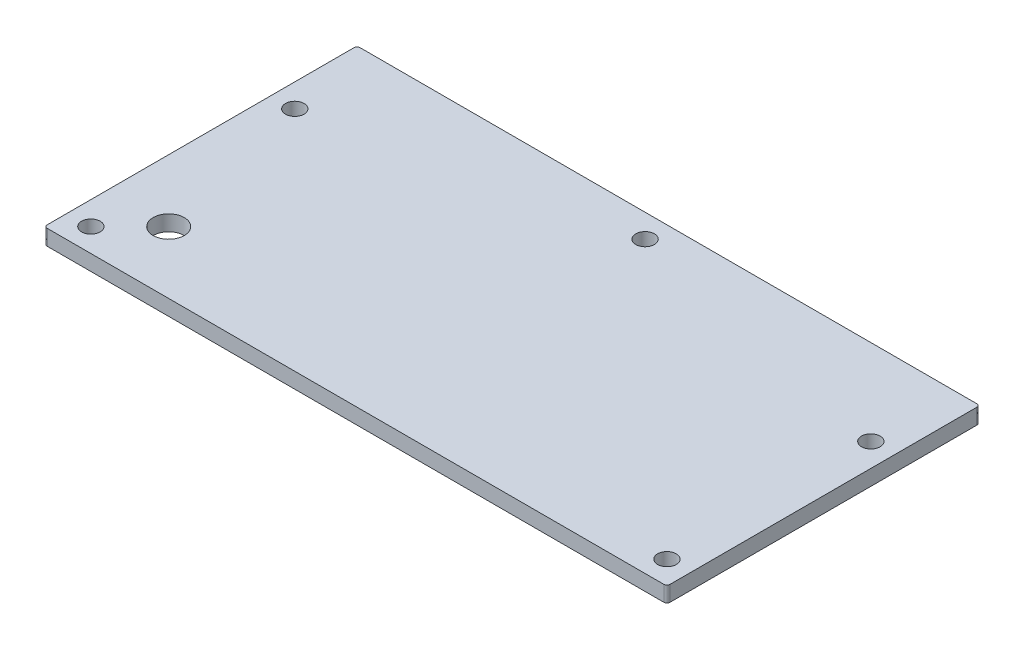
ISO-10303-21;
HEADER;
FILE_DESCRIPTION(('STEP AP214'),'2;1');
FILE_NAME('part.step','',(''),(''),'','','');
FILE_SCHEMA(('AUTOMOTIVE_DESIGN { 1 0 10303 214 1 1 1 1 }'));
ENDSEC;
DATA;
#1=APPLICATION_CONTEXT('core data for automotive mechanical design processes');
#2=APPLICATION_PROTOCOL_DEFINITION('international standard','automotive_design',2000,#1);
#3=PRODUCT_CONTEXT('',#1,'mechanical');
#4=PRODUCT('Part','Part','',(#3));
#5=PRODUCT_RELATED_PRODUCT_CATEGORY('part','',(#4));
#6=PRODUCT_DEFINITION_FORMATION('','',#4);
#7=PRODUCT_DEFINITION_CONTEXT('part definition',#1,'design');
#8=PRODUCT_DEFINITION('design','',#6,#7);
#9=PRODUCT_DEFINITION_SHAPE('','',#8);
#10=(LENGTH_UNIT() NAMED_UNIT(*) SI_UNIT(.MILLI.,.METRE.));
#11=(NAMED_UNIT(*) PLANE_ANGLE_UNIT() SI_UNIT($,.RADIAN.));
#12=(NAMED_UNIT(*) SI_UNIT($,.STERADIAN.) SOLID_ANGLE_UNIT());
#13=UNCERTAINTY_MEASURE_WITH_UNIT(LENGTH_MEASURE(1.E-05),#10,'distance_accuracy_value','');
#14=(GEOMETRIC_REPRESENTATION_CONTEXT(3) GLOBAL_UNCERTAINTY_ASSIGNED_CONTEXT((#13)) GLOBAL_UNIT_ASSIGNED_CONTEXT((#10,
#11,#12)) REPRESENTATION_CONTEXT('',''));
#15=CARTESIAN_POINT('',(0.,0.,0.));
#16=DIRECTION('',(0.,0.,1.));
#17=DIRECTION('',(1.,0.,0.));
#18=AXIS2_PLACEMENT_3D('',#15,#16,#17);
#19=CARTESIAN_POINT('',(63.5,3.175,31.9024));
#20=DIRECTION('',(-1.,0.,0.));
#21=DIRECTION('',(0.,0.,1.));
#22=AXIS2_PLACEMENT_3D('',#19,#20,#21);
#23=PLANE('',#22);
#24=DIRECTION('',(0.,0.,-1.));
#25=VECTOR('',#24,1.);
#26=CARTESIAN_POINT('',(63.5,3.175,31.9024));
#27=LINE('',#26,#25);
#28=CARTESIAN_POINT('',(63.5,3.175,31.2674));
#29=VERTEX_POINT('',#28);
#30=CARTESIAN_POINT('',(63.5,3.175,-31.2674));
#31=VERTEX_POINT('',#30);
#32=EDGE_CURVE('E127',#29,#31,#27,.T.);
#33=ORIENTED_EDGE('',*,*,#32,.F.);
#34=DIRECTION('',(0.,-1.,0.));
#35=VECTOR('',#34,1.);
#36=CARTESIAN_POINT('',(63.5,3.175,31.2674));
#37=LINE('',#36,#35);
#38=CARTESIAN_POINT('',(63.5,0.,31.2674));
#39=VERTEX_POINT('',#38);
#40=EDGE_CURVE('E153',#29,#39,#37,.T.);
#41=ORIENTED_EDGE('',*,*,#40,.T.);
#42=DIRECTION('',(0.,0.,-1.));
#43=VECTOR('',#42,1.);
#44=CARTESIAN_POINT('',(63.5,0.,31.9024));
#45=LINE('',#44,#43);
#46=CARTESIAN_POINT('',(63.5,0.,-31.2674));
#47=VERTEX_POINT('',#46);
#48=EDGE_CURVE('E159',#39,#47,#45,.T.);
#49=ORIENTED_EDGE('',*,*,#48,.T.);
#50=DIRECTION('',(0.,-1.,0.));
#51=VECTOR('',#50,1.);
#52=CARTESIAN_POINT('',(63.5,3.175,-31.2674));
#53=LINE('',#52,#51);
#54=EDGE_CURVE('E151',#47,#31,#53,.F.);
#55=ORIENTED_EDGE('',*,*,#54,.T.);
#56=EDGE_LOOP('',(#33,#41,#49,#55));
#57=FACE_BOUND('',#56,.T.);
#58=ADVANCED_FACE('F35',(#57),#23,.F.);
#59=CARTESIAN_POINT('',(-63.5,3.175,-31.9024));
#60=DIRECTION('',(0.,0.,1.));
#61=DIRECTION('',(1.,0.,0.));
#62=AXIS2_PLACEMENT_3D('',#59,#60,#61);
#63=PLANE('',#62);
#64=DIRECTION('',(-1.,0.,0.));
#65=VECTOR('',#64,1.);
#66=CARTESIAN_POINT('',(-63.5,3.175,-31.9024));
#67=LINE('',#66,#65);
#68=CARTESIAN_POINT('',(62.865,3.175,-31.9024));
#69=VERTEX_POINT('',#68);
#70=CARTESIAN_POINT('',(-62.865,3.175,-31.9024));
#71=VERTEX_POINT('',#70);
#72=EDGE_CURVE('E130',#69,#71,#67,.T.);
#73=ORIENTED_EDGE('',*,*,#72,.F.);
#74=DIRECTION('',(0.,-1.,0.));
#75=VECTOR('',#74,1.);
#76=CARTESIAN_POINT('',(62.865,3.175,-31.9024));
#77=LINE('',#76,#75);
#78=CARTESIAN_POINT('',(62.865,0.,-31.9024));
#79=VERTEX_POINT('',#78);
#80=EDGE_CURVE('E11',#69,#79,#77,.T.);
#81=ORIENTED_EDGE('',*,*,#80,.T.);
#82=DIRECTION('',(-1.,0.,0.));
#83=VECTOR('',#82,1.);
#84=CARTESIAN_POINT('',(-63.5,0.,-31.9024));
#85=LINE('',#84,#83);
#86=CARTESIAN_POINT('',(-62.865,0.,-31.9024));
#87=VERTEX_POINT('',#86);
#88=EDGE_CURVE('E132',#79,#87,#85,.T.);
#89=ORIENTED_EDGE('',*,*,#88,.T.);
#90=DIRECTION('',(0.,-1.,0.));
#91=VECTOR('',#90,1.);
#92=CARTESIAN_POINT('',(-62.865,3.175,-31.9024));
#93=LINE('',#92,#91);
#94=EDGE_CURVE('E43',#87,#71,#93,.F.);
#95=ORIENTED_EDGE('',*,*,#94,.T.);
#96=EDGE_LOOP('',(#73,#81,#89,#95));
#97=FACE_BOUND('',#96,.T.);
#98=ADVANCED_FACE('F236',(#97),#63,.F.);
#99=CARTESIAN_POINT('',(-63.5,3.175,31.9024));
#100=DIRECTION('',(1.,0.,0.));
#101=DIRECTION('',(0.,0.,-1.));
#102=AXIS2_PLACEMENT_3D('',#99,#100,#101);
#103=PLANE('',#102);
#104=DIRECTION('',(0.,0.,1.));
#105=VECTOR('',#104,1.);
#106=CARTESIAN_POINT('',(-63.5,0.,31.9024));
#107=LINE('',#106,#105);
#108=CARTESIAN_POINT('',(-63.5,0.,-31.2674));
#109=VERTEX_POINT('',#108);
#110=CARTESIAN_POINT('',(-63.5,0.,31.2674));
#111=VERTEX_POINT('',#110);
#112=EDGE_CURVE('E128',#109,#111,#107,.T.);
#113=ORIENTED_EDGE('',*,*,#112,.T.);
#114=DIRECTION('',(0.,-1.,0.));
#115=VECTOR('',#114,1.);
#116=CARTESIAN_POINT('',(-63.5,3.175,31.2674));
#117=LINE('',#116,#115);
#118=CARTESIAN_POINT('',(-63.5,3.175,31.2674));
#119=VERTEX_POINT('',#118);
#120=EDGE_CURVE('E106',#111,#119,#117,.F.);
#121=ORIENTED_EDGE('',*,*,#120,.T.);
#122=DIRECTION('',(0.,0.,1.));
#123=VECTOR('',#122,1.);
#124=CARTESIAN_POINT('',(-63.5,3.175,31.9024));
#125=LINE('',#124,#123);
#126=CARTESIAN_POINT('',(-63.5,3.175,-31.2674));
#127=VERTEX_POINT('',#126);
#128=EDGE_CURVE('E171',#127,#119,#125,.T.);
#129=ORIENTED_EDGE('',*,*,#128,.F.);
#130=DIRECTION('',(0.,-1.,0.));
#131=VECTOR('',#130,1.);
#132=CARTESIAN_POINT('',(-63.5,3.175,-31.2674));
#133=LINE('',#132,#131);
#134=EDGE_CURVE('E111',#127,#109,#133,.T.);
#135=ORIENTED_EDGE('',*,*,#134,.T.);
#136=EDGE_LOOP('',(#113,#121,#129,#135));
#137=FACE_BOUND('',#136,.T.);
#138=ADVANCED_FACE('F234',(#137),#103,.F.);
#139=CARTESIAN_POINT('',(-63.5,3.175,31.9024));
#140=DIRECTION('',(0.,0.,-1.));
#141=DIRECTION('',(-1.,0.,0.));
#142=AXIS2_PLACEMENT_3D('',#139,#140,#141);
#143=PLANE('',#142);
#144=DIRECTION('',(1.,0.,0.));
#145=VECTOR('',#144,1.);
#146=CARTESIAN_POINT('',(-63.5,3.175,31.9024));
#147=LINE('',#146,#145);
#148=CARTESIAN_POINT('',(-62.865,3.175,31.9024));
#149=VERTEX_POINT('',#148);
#150=CARTESIAN_POINT('',(62.865,3.175,31.9024));
#151=VERTEX_POINT('',#150);
#152=EDGE_CURVE('E121',#149,#151,#147,.T.);
#153=ORIENTED_EDGE('',*,*,#152,.F.);
#154=DIRECTION('',(0.,-1.,0.));
#155=VECTOR('',#154,1.);
#156=CARTESIAN_POINT('',(-62.865,3.175,31.9024));
#157=LINE('',#156,#155);
#158=CARTESIAN_POINT('',(-62.865,0.,31.9024));
#159=VERTEX_POINT('',#158);
#160=EDGE_CURVE('E105',#149,#159,#157,.T.);
#161=ORIENTED_EDGE('',*,*,#160,.T.);
#162=DIRECTION('',(1.,0.,0.));
#163=VECTOR('',#162,1.);
#164=CARTESIAN_POINT('',(-63.5,0.,31.9024));
#165=LINE('',#164,#163);
#166=CARTESIAN_POINT('',(62.865,0.,31.9024));
#167=VERTEX_POINT('',#166);
#168=EDGE_CURVE('E118',#159,#167,#165,.T.);
#169=ORIENTED_EDGE('',*,*,#168,.T.);
#170=DIRECTION('',(0.,-1.,0.));
#171=VECTOR('',#170,1.);
#172=CARTESIAN_POINT('',(62.865,3.175,31.9024));
#173=LINE('',#172,#171);
#174=EDGE_CURVE('E123',#167,#151,#173,.F.);
#175=ORIENTED_EDGE('',*,*,#174,.T.);
#176=EDGE_LOOP('',(#153,#161,#169,#175));
#177=FACE_BOUND('',#176,.T.);
#178=ADVANCED_FACE('F117',(#177),#143,.F.);
#179=CARTESIAN_POINT('',(0.,3.175,0.));
#180=DIRECTION('',(0.,-1.,0.));
#181=DIRECTION('',(0.,0.,-1.));
#182=AXIS2_PLACEMENT_3D('',#179,#180,#181);
#183=PLANE('',#182);
#184=CARTESIAN_POINT('',(-50.8,3.175,19.2024));
#185=DIRECTION('',(0.,1.,0.));
#186=DIRECTION('',(0.,0.,1.));
#187=AXIS2_PLACEMENT_3D('',#184,#185,#186);
#188=CIRCLE('',#187,3.175);
#189=CARTESIAN_POINT('',(-50.8,3.175,22.3774));
#190=VERTEX_POINT('',#189);
#191=EDGE_CURVE('E202',#190,#190,#188,.T.);
#192=ORIENTED_EDGE('',*,*,#191,.F.);
#193=EDGE_LOOP('',(#192));
#194=FACE_BOUND('',#193,.T.);
#195=CARTESIAN_POINT('',(-58.7375,3.175,-14.4399));
#196=DIRECTION('',(0.,1.,0.));
#197=DIRECTION('',(0.,0.,1.));
#198=AXIS2_PLACEMENT_3D('',#195,#196,#197);
#199=CIRCLE('',#198,1.89865);
#200=CARTESIAN_POINT('',(-58.7375,3.175,-12.54125));
#201=VERTEX_POINT('',#200);
#202=EDGE_CURVE('E185',#201,#201,#199,.T.);
#203=ORIENTED_EDGE('',*,*,#202,.F.);
#204=EDGE_LOOP('',(#203));
#205=FACE_BOUND('',#204,.T.);
#206=CARTESIAN_POINT('',(58.7375,3.175,-14.4399));
#207=DIRECTION('',(0.,1.,0.));
#208=DIRECTION('',(0.,0.,1.));
#209=AXIS2_PLACEMENT_3D('',#206,#207,#208);
#210=CIRCLE('',#209,1.89865);
#211=CARTESIAN_POINT('',(58.7375,3.175,-12.54125));
#212=VERTEX_POINT('',#211);
#213=EDGE_CURVE('E178',#212,#212,#210,.T.);
#214=ORIENTED_EDGE('',*,*,#213,.F.);
#215=EDGE_LOOP('',(#214));
#216=FACE_BOUND('',#215,.T.);
#217=CARTESIAN_POINT('',(58.7375,3.175,27.1399));
#218=DIRECTION('',(0.,1.,0.));
#219=DIRECTION('',(0.,0.,1.));
#220=AXIS2_PLACEMENT_3D('',#217,#218,#219);
#221=CIRCLE('',#220,1.89865);
#222=CARTESIAN_POINT('',(58.7375,3.175,29.03855));
#223=VERTEX_POINT('',#222);
#224=EDGE_CURVE('E197',#223,#223,#221,.T.);
#225=ORIENTED_EDGE('',*,*,#224,.F.);
#226=EDGE_LOOP('',(#225));
#227=FACE_BOUND('',#226,.T.);
#228=CARTESIAN_POINT('',(0.,3.175,-27.1399));
#229=DIRECTION('',(0.,1.,0.));
#230=DIRECTION('',(0.,0.,1.));
#231=AXIS2_PLACEMENT_3D('',#228,#229,#230);
#232=CIRCLE('',#231,1.89865);
#233=CARTESIAN_POINT('',(0.,3.175,-25.24125));
#234=VERTEX_POINT('',#233);
#235=EDGE_CURVE('E190',#234,#234,#232,.T.);
#236=ORIENTED_EDGE('',*,*,#235,.F.);
#237=EDGE_LOOP('',(#236));
#238=FACE_BOUND('',#237,.T.);
#239=CARTESIAN_POINT('',(-58.7375,3.175,27.1399));
#240=DIRECTION('',(0.,1.,0.));
#241=DIRECTION('',(0.,0.,1.));
#242=AXIS2_PLACEMENT_3D('',#239,#240,#241);
#243=CIRCLE('',#242,1.89865);
#244=CARTESIAN_POINT('',(-58.7375,3.175,29.03855));
#245=VERTEX_POINT('',#244);
#246=EDGE_CURVE('E167',#245,#245,#243,.T.);
#247=ORIENTED_EDGE('',*,*,#246,.F.);
#248=EDGE_LOOP('',(#247));
#249=FACE_BOUND('',#248,.T.);
#250=ORIENTED_EDGE('',*,*,#128,.T.);
#251=CARTESIAN_POINT('',(-62.865,3.175,31.2674));
#252=DIRECTION('',(0.,-1.,0.));
#253=DIRECTION('',(0.,0.,-1.));
#254=AXIS2_PLACEMENT_3D('',#251,#252,#253);
#255=CIRCLE('',#254,0.635);
#256=EDGE_CURVE('E149',#119,#149,#255,.F.);
#257=ORIENTED_EDGE('',*,*,#256,.T.);
#258=ORIENTED_EDGE('',*,*,#152,.T.);
#259=CARTESIAN_POINT('',(62.865,3.175,31.2674));
#260=DIRECTION('',(0.,-1.,0.));
#261=DIRECTION('',(0.,0.,-1.));
#262=AXIS2_PLACEMENT_3D('',#259,#260,#261);
#263=CIRCLE('',#262,0.635);
#264=EDGE_CURVE('E147',#151,#29,#263,.F.);
#265=ORIENTED_EDGE('',*,*,#264,.T.);
#266=ORIENTED_EDGE('',*,*,#32,.T.);
#267=CARTESIAN_POINT('',(62.865,3.175,-31.2674));
#268=DIRECTION('',(0.,-1.,0.));
#269=DIRECTION('',(0.,0.,-1.));
#270=AXIS2_PLACEMENT_3D('',#267,#268,#269);
#271=CIRCLE('',#270,0.635);
#272=EDGE_CURVE('E56',#31,#69,#271,.F.);
#273=ORIENTED_EDGE('',*,*,#272,.T.);
#274=ORIENTED_EDGE('',*,*,#72,.T.);
#275=CARTESIAN_POINT('',(-62.865,3.175,-31.2674));
#276=DIRECTION('',(0.,-1.,0.));
#277=DIRECTION('',(0.,0.,-1.));
#278=AXIS2_PLACEMENT_3D('',#275,#276,#277);
#279=CIRCLE('',#278,0.635);
#280=EDGE_CURVE('E144',#71,#127,#279,.F.);
#281=ORIENTED_EDGE('',*,*,#280,.T.);
#282=EDGE_LOOP('',(#250,#257,#258,#265,#266,#273,#274,#281));
#283=FACE_BOUND('',#282,.T.);
#284=ADVANCED_FACE('F217',(#194,#205,#216,#227,#238,#249,#283),#183,.F.);
#285=CARTESIAN_POINT('',(0.,0.,0.));
#286=DIRECTION('',(0.,-1.,0.));
#287=DIRECTION('',(0.,0.,-1.));
#288=AXIS2_PLACEMENT_3D('',#285,#286,#287);
#289=PLANE('',#288);
#290=CARTESIAN_POINT('',(-50.8,0.,19.2024));
#291=DIRECTION('',(0.,1.,0.));
#292=DIRECTION('',(0.,0.,1.));
#293=AXIS2_PLACEMENT_3D('',#290,#291,#292);
#294=CIRCLE('',#293,3.175);
#295=CARTESIAN_POINT('',(-50.8,0.,22.3774));
#296=VERTEX_POINT('',#295);
#297=EDGE_CURVE('E194',#296,#296,#294,.T.);
#298=ORIENTED_EDGE('',*,*,#297,.T.);
#299=EDGE_LOOP('',(#298));
#300=FACE_BOUND('',#299,.T.);
#301=CARTESIAN_POINT('',(-58.7375,0.,-14.4399));
#302=DIRECTION('',(0.,1.,0.));
#303=DIRECTION('',(0.,0.,1.));
#304=AXIS2_PLACEMENT_3D('',#301,#302,#303);
#305=CIRCLE('',#304,1.89865);
#306=CARTESIAN_POINT('',(-58.7375,0.,-12.54125));
#307=VERTEX_POINT('',#306);
#308=EDGE_CURVE('E176',#307,#307,#305,.T.);
#309=ORIENTED_EDGE('',*,*,#308,.T.);
#310=EDGE_LOOP('',(#309));
#311=FACE_BOUND('',#310,.T.);
#312=CARTESIAN_POINT('',(58.7375,0.,-14.4399));
#313=DIRECTION('',(0.,1.,0.));
#314=DIRECTION('',(0.,0.,1.));
#315=AXIS2_PLACEMENT_3D('',#312,#313,#314);
#316=CIRCLE('',#315,1.89865);
#317=CARTESIAN_POINT('',(58.7375,0.,-12.54125));
#318=VERTEX_POINT('',#317);
#319=EDGE_CURVE('E181',#318,#318,#316,.T.);
#320=ORIENTED_EDGE('',*,*,#319,.T.);
#321=EDGE_LOOP('',(#320));
#322=FACE_BOUND('',#321,.T.);
#323=CARTESIAN_POINT('',(58.7375,0.,27.1399));
#324=DIRECTION('',(0.,1.,0.));
#325=DIRECTION('',(0.,0.,1.));
#326=AXIS2_PLACEMENT_3D('',#323,#324,#325);
#327=CIRCLE('',#326,1.89865);
#328=CARTESIAN_POINT('',(58.7375,0.,29.03855));
#329=VERTEX_POINT('',#328);
#330=EDGE_CURVE('E182',#329,#329,#327,.T.);
#331=ORIENTED_EDGE('',*,*,#330,.T.);
#332=EDGE_LOOP('',(#331));
#333=FACE_BOUND('',#332,.T.);
#334=CARTESIAN_POINT('',(0.,0.,-27.1399));
#335=DIRECTION('',(0.,1.,0.));
#336=DIRECTION('',(0.,0.,1.));
#337=AXIS2_PLACEMENT_3D('',#334,#335,#336);
#338=CIRCLE('',#337,1.89865);
#339=CARTESIAN_POINT('',(0.,0.,-25.24125));
#340=VERTEX_POINT('',#339);
#341=EDGE_CURVE('E193',#340,#340,#338,.T.);
#342=ORIENTED_EDGE('',*,*,#341,.T.);
#343=EDGE_LOOP('',(#342));
#344=FACE_BOUND('',#343,.T.);
#345=CARTESIAN_POINT('',(-58.7375,0.,27.1399));
#346=DIRECTION('',(0.,1.,0.));
#347=DIRECTION('',(0.,0.,1.));
#348=AXIS2_PLACEMENT_3D('',#345,#346,#347);
#349=CIRCLE('',#348,1.89865);
#350=CARTESIAN_POINT('',(-58.7375,0.,29.03855));
#351=VERTEX_POINT('',#350);
#352=EDGE_CURVE('E164',#351,#351,#349,.T.);
#353=ORIENTED_EDGE('',*,*,#352,.T.);
#354=EDGE_LOOP('',(#353));
#355=FACE_BOUND('',#354,.T.);
#356=ORIENTED_EDGE('',*,*,#168,.F.);
#357=CARTESIAN_POINT('',(-62.865,0.,31.2674));
#358=DIRECTION('',(0.,-1.,0.));
#359=DIRECTION('',(0.,0.,-1.));
#360=AXIS2_PLACEMENT_3D('',#357,#358,#359);
#361=CIRCLE('',#360,0.635);
#362=EDGE_CURVE('E101',#159,#111,#361,.T.);
#363=ORIENTED_EDGE('',*,*,#362,.T.);
#364=ORIENTED_EDGE('',*,*,#112,.F.);
#365=CARTESIAN_POINT('',(-62.865,0.,-31.2674));
#366=DIRECTION('',(0.,-1.,0.));
#367=DIRECTION('',(0.,0.,-1.));
#368=AXIS2_PLACEMENT_3D('',#365,#366,#367);
#369=CIRCLE('',#368,0.635);
#370=EDGE_CURVE('E122',#109,#87,#369,.T.);
#371=ORIENTED_EDGE('',*,*,#370,.T.);
#372=ORIENTED_EDGE('',*,*,#88,.F.);
#373=CARTESIAN_POINT('',(62.865,0.,-31.2674));
#374=DIRECTION('',(0.,-1.,0.));
#375=DIRECTION('',(0.,0.,-1.));
#376=AXIS2_PLACEMENT_3D('',#373,#374,#375);
#377=CIRCLE('',#376,0.635);
#378=EDGE_CURVE('E138',#79,#47,#377,.T.);
#379=ORIENTED_EDGE('',*,*,#378,.T.);
#380=ORIENTED_EDGE('',*,*,#48,.F.);
#381=CARTESIAN_POINT('',(62.865,0.,31.2674));
#382=DIRECTION('',(0.,-1.,0.));
#383=DIRECTION('',(0.,0.,-1.));
#384=AXIS2_PLACEMENT_3D('',#381,#382,#383);
#385=CIRCLE('',#384,0.635);
#386=EDGE_CURVE('E112',#39,#167,#385,.T.);
#387=ORIENTED_EDGE('',*,*,#386,.T.);
#388=EDGE_LOOP('',(#356,#363,#364,#371,#372,#379,#380,#387));
#389=FACE_BOUND('',#388,.T.);
#390=ADVANCED_FACE('F125',(#300,#311,#322,#333,#344,#355,#389),#289,.T.);
#391=CARTESIAN_POINT('',(-58.7375,0.,27.1399));
#392=DIRECTION('',(0.,1.,0.));
#393=DIRECTION('',(0.,0.,1.));
#394=AXIS2_PLACEMENT_3D('',#391,#392,#393);
#395=CYLINDRICAL_SURFACE('',#394,1.89865);
#396=ORIENTED_EDGE('',*,*,#352,.F.);
#397=EDGE_LOOP('',(#396));
#398=FACE_BOUND('',#397,.T.);
#399=ORIENTED_EDGE('',*,*,#246,.T.);
#400=EDGE_LOOP('',(#399));
#401=FACE_BOUND('',#400,.T.);
#402=ADVANCED_FACE('F260',(#398,#401),#395,.F.);
#403=CARTESIAN_POINT('',(0.,0.,-27.1399));
#404=DIRECTION('',(0.,1.,0.));
#405=DIRECTION('',(0.,0.,1.));
#406=AXIS2_PLACEMENT_3D('',#403,#404,#405);
#407=CYLINDRICAL_SURFACE('',#406,1.89865);
#408=ORIENTED_EDGE('',*,*,#341,.F.);
#409=EDGE_LOOP('',(#408));
#410=FACE_BOUND('',#409,.T.);
#411=ORIENTED_EDGE('',*,*,#235,.T.);
#412=EDGE_LOOP('',(#411));
#413=FACE_BOUND('',#412,.T.);
#414=ADVANCED_FACE('F264',(#410,#413),#407,.F.);
#415=CARTESIAN_POINT('',(58.7375,0.,27.1399));
#416=DIRECTION('',(0.,1.,0.));
#417=DIRECTION('',(0.,0.,1.));
#418=AXIS2_PLACEMENT_3D('',#415,#416,#417);
#419=CYLINDRICAL_SURFACE('',#418,1.89865);
#420=ORIENTED_EDGE('',*,*,#330,.F.);
#421=EDGE_LOOP('',(#420));
#422=FACE_BOUND('',#421,.T.);
#423=ORIENTED_EDGE('',*,*,#224,.T.);
#424=EDGE_LOOP('',(#423));
#425=FACE_BOUND('',#424,.T.);
#426=ADVANCED_FACE('F269',(#422,#425),#419,.F.);
#427=CARTESIAN_POINT('',(58.7375,0.,-14.4399));
#428=DIRECTION('',(0.,1.,0.));
#429=DIRECTION('',(0.,0.,1.));
#430=AXIS2_PLACEMENT_3D('',#427,#428,#429);
#431=CYLINDRICAL_SURFACE('',#430,1.89865);
#432=ORIENTED_EDGE('',*,*,#319,.F.);
#433=EDGE_LOOP('',(#432));
#434=FACE_BOUND('',#433,.T.);
#435=ORIENTED_EDGE('',*,*,#213,.T.);
#436=EDGE_LOOP('',(#435));
#437=FACE_BOUND('',#436,.T.);
#438=ADVANCED_FACE('F266',(#434,#437),#431,.F.);
#439=CARTESIAN_POINT('',(-58.7375,0.,-14.4399));
#440=DIRECTION('',(0.,1.,0.));
#441=DIRECTION('',(0.,0.,1.));
#442=AXIS2_PLACEMENT_3D('',#439,#440,#441);
#443=CYLINDRICAL_SURFACE('',#442,1.89865);
#444=ORIENTED_EDGE('',*,*,#308,.F.);
#445=EDGE_LOOP('',(#444));
#446=FACE_BOUND('',#445,.T.);
#447=ORIENTED_EDGE('',*,*,#202,.T.);
#448=EDGE_LOOP('',(#447));
#449=FACE_BOUND('',#448,.T.);
#450=ADVANCED_FACE('F213',(#446,#449),#443,.F.);
#451=CARTESIAN_POINT('',(-50.8,0.,19.2024));
#452=DIRECTION('',(0.,1.,0.));
#453=DIRECTION('',(0.,0.,1.));
#454=AXIS2_PLACEMENT_3D('',#451,#452,#453);
#455=CYLINDRICAL_SURFACE('',#454,3.175);
#456=ORIENTED_EDGE('',*,*,#297,.F.);
#457=EDGE_LOOP('',(#456));
#458=FACE_BOUND('',#457,.T.);
#459=ORIENTED_EDGE('',*,*,#191,.T.);
#460=EDGE_LOOP('',(#459));
#461=FACE_BOUND('',#460,.T.);
#462=ADVANCED_FACE('F210',(#458,#461),#455,.F.);
#463=CARTESIAN_POINT('',(-62.865,3.175,31.2674));
#464=DIRECTION('',(0.,-1.,0.));
#465=DIRECTION('',(0.,0.,-1.));
#466=AXIS2_PLACEMENT_3D('',#463,#464,#465);
#467=CYLINDRICAL_SURFACE('',#466,0.635);
#468=ORIENTED_EDGE('',*,*,#256,.F.);
#469=ORIENTED_EDGE('',*,*,#120,.F.);
#470=ORIENTED_EDGE('',*,*,#362,.F.);
#471=ORIENTED_EDGE('',*,*,#160,.F.);
#472=EDGE_LOOP('',(#468,#469,#470,#471));
#473=FACE_BOUND('',#472,.T.);
#474=ADVANCED_FACE('F104',(#473),#467,.T.);
#475=CARTESIAN_POINT('',(62.865,3.175,31.2674));
#476=DIRECTION('',(0.,-1.,0.));
#477=DIRECTION('',(0.,0.,-1.));
#478=AXIS2_PLACEMENT_3D('',#475,#476,#477);
#479=CYLINDRICAL_SURFACE('',#478,0.635);
#480=ORIENTED_EDGE('',*,*,#264,.F.);
#481=ORIENTED_EDGE('',*,*,#174,.F.);
#482=ORIENTED_EDGE('',*,*,#386,.F.);
#483=ORIENTED_EDGE('',*,*,#40,.F.);
#484=EDGE_LOOP('',(#480,#481,#482,#483));
#485=FACE_BOUND('',#484,.T.);
#486=ADVANCED_FACE('F240',(#485),#479,.T.);
#487=CARTESIAN_POINT('',(62.865,3.175,-31.2674));
#488=DIRECTION('',(0.,-1.,0.));
#489=DIRECTION('',(0.,0.,-1.));
#490=AXIS2_PLACEMENT_3D('',#487,#488,#489);
#491=CYLINDRICAL_SURFACE('',#490,0.635);
#492=ORIENTED_EDGE('',*,*,#272,.F.);
#493=ORIENTED_EDGE('',*,*,#54,.F.);
#494=ORIENTED_EDGE('',*,*,#378,.F.);
#495=ORIENTED_EDGE('',*,*,#80,.F.);
#496=EDGE_LOOP('',(#492,#493,#494,#495));
#497=FACE_BOUND('',#496,.T.);
#498=ADVANCED_FACE('F239',(#497),#491,.T.);
#499=CARTESIAN_POINT('',(-62.865,3.175,-31.2674));
#500=DIRECTION('',(0.,-1.,0.));
#501=DIRECTION('',(0.,0.,-1.));
#502=AXIS2_PLACEMENT_3D('',#499,#500,#501);
#503=CYLINDRICAL_SURFACE('',#502,0.635);
#504=ORIENTED_EDGE('',*,*,#280,.F.);
#505=ORIENTED_EDGE('',*,*,#94,.F.);
#506=ORIENTED_EDGE('',*,*,#370,.F.);
#507=ORIENTED_EDGE('',*,*,#134,.F.);
#508=EDGE_LOOP('',(#504,#505,#506,#507));
#509=FACE_BOUND('',#508,.T.);
#510=ADVANCED_FACE('F37',(#509),#503,.T.);
#511=CLOSED_SHELL('',(#58,#98,#138,#178,#284,#390,#402,#414,#426,#438,#450,#462,#474,#486,#498,#510));
#512=MANIFOLD_SOLID_BREP('B2',#511);
#513=ADVANCED_BREP_SHAPE_REPRESENTATION('',(#18,#512),#14);
#514=SHAPE_DEFINITION_REPRESENTATION(#9,#513);
ENDSEC;
END-ISO-10303-21;
